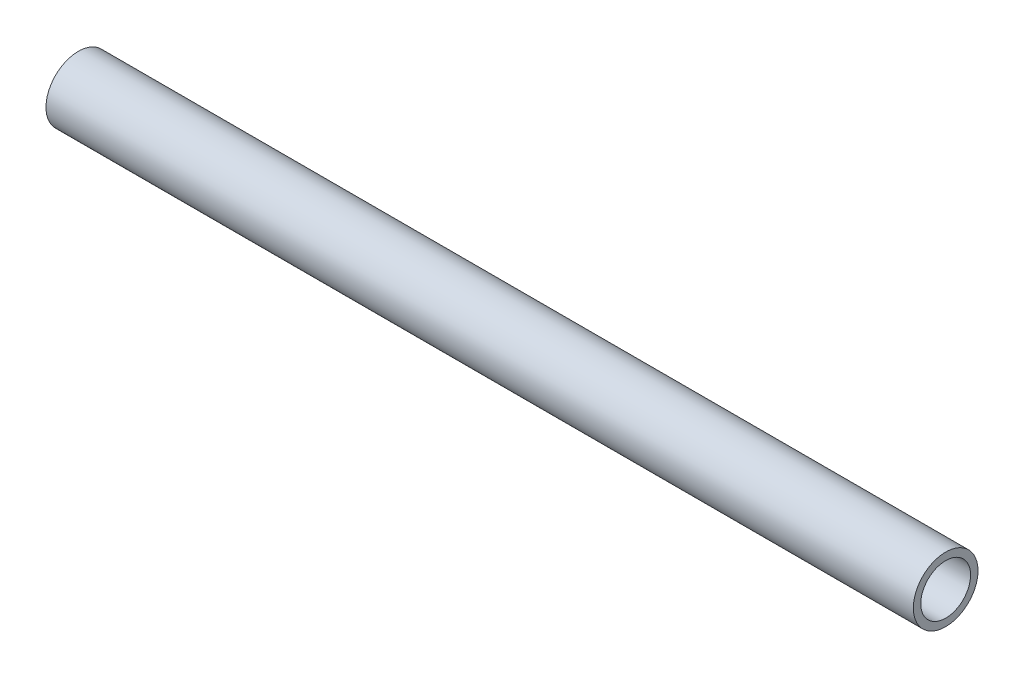
ISO-10303-21;
HEADER;
FILE_DESCRIPTION(('STEP AP214'),'2;1');
FILE_NAME('part.step','',(''),(''),'','','');
FILE_SCHEMA(('AUTOMOTIVE_DESIGN { 1 0 10303 214 1 1 1 1 }'));
ENDSEC;
DATA;
#1=APPLICATION_CONTEXT('core data for automotive mechanical design processes');
#2=APPLICATION_PROTOCOL_DEFINITION('international standard','automotive_design',2000,#1);
#3=PRODUCT_CONTEXT('',#1,'mechanical');
#4=PRODUCT('Part','Part','',(#3));
#5=PRODUCT_RELATED_PRODUCT_CATEGORY('part','',(#4));
#6=PRODUCT_DEFINITION_FORMATION('','',#4);
#7=PRODUCT_DEFINITION_CONTEXT('part definition',#1,'design');
#8=PRODUCT_DEFINITION('design','',#6,#7);
#9=PRODUCT_DEFINITION_SHAPE('','',#8);
#10=(LENGTH_UNIT() NAMED_UNIT(*) SI_UNIT(.MILLI.,.METRE.));
#11=(NAMED_UNIT(*) PLANE_ANGLE_UNIT() SI_UNIT($,.RADIAN.));
#12=(NAMED_UNIT(*) SI_UNIT($,.STERADIAN.) SOLID_ANGLE_UNIT());
#13=UNCERTAINTY_MEASURE_WITH_UNIT(LENGTH_MEASURE(1.E-05),#10,'distance_accuracy_value','');
#14=(GEOMETRIC_REPRESENTATION_CONTEXT(3) GLOBAL_UNCERTAINTY_ASSIGNED_CONTEXT((#13)) GLOBAL_UNIT_ASSIGNED_CONTEXT((#10,
#11,#12)) REPRESENTATION_CONTEXT('',''));
#15=CARTESIAN_POINT('',(0.,0.,0.));
#16=DIRECTION('',(0.,0.,1.));
#17=DIRECTION('',(1.,0.,0.));
#18=AXIS2_PLACEMENT_3D('',#15,#16,#17);
#19=CARTESIAN_POINT('',(-110.229678615723,0.,0.));
#20=DIRECTION('',(-1.,0.,0.));
#21=DIRECTION('',(0.,-1.,0.));
#22=AXIS2_PLACEMENT_3D('',#19,#20,#21);
#23=CYLINDRICAL_SURFACE('',#22,8.57249999999996);
#24=CARTESIAN_POINT('',(-140.,0.,0.));
#25=DIRECTION('',(-1.,0.,0.));
#26=DIRECTION('',(0.,-1.,0.));
#27=AXIS2_PLACEMENT_3D('',#24,#25,#26);
#28=CIRCLE('',#27,8.57249999999995);
#29=CARTESIAN_POINT('',(-140.,-8.57249999999995,0.));
#30=VERTEX_POINT('',#29);
#31=EDGE_CURVE('E56',#30,#30,#28,.T.);
#32=ORIENTED_EDGE('',*,*,#31,.F.);
#33=EDGE_LOOP('',(#32));
#34=FACE_BOUND('',#33,.T.);
#35=CARTESIAN_POINT('',(89.8802,0.,0.));
#36=DIRECTION('',(-1.,0.,0.));
#37=DIRECTION('',(0.,-1.,0.));
#38=AXIS2_PLACEMENT_3D('',#35,#36,#37);
#39=CIRCLE('',#38,8.57249999999997);
#40=CARTESIAN_POINT('',(89.8802,-8.57249999999995,0.));
#41=VERTEX_POINT('',#40);
#42=EDGE_CURVE('E10',#41,#41,#39,.T.);
#43=ORIENTED_EDGE('',*,*,#42,.T.);
#44=EDGE_LOOP('',(#43));
#45=FACE_BOUND('',#44,.T.);
#46=ADVANCED_FACE('F28',(#34,#45),#23,.T.);
#47=CARTESIAN_POINT('',(89.8802,6.60400000000001,0.));
#48=DIRECTION('',(-1.,0.,0.));
#49=DIRECTION('',(0.,-1.,0.));
#50=AXIS2_PLACEMENT_3D('',#47,#48,#49);
#51=PLANE('',#50);
#52=ORIENTED_EDGE('',*,*,#42,.F.);
#53=EDGE_LOOP('',(#52));
#54=FACE_BOUND('',#53,.T.);
#55=CARTESIAN_POINT('',(89.8802,0.,0.));
#56=DIRECTION('',(-1.,0.,0.));
#57=DIRECTION('',(0.,-1.,0.));
#58=AXIS2_PLACEMENT_3D('',#55,#56,#57);
#59=CIRCLE('',#58,6.60399999999998);
#60=CARTESIAN_POINT('',(89.8802,-6.60399999999996,0.));
#61=VERTEX_POINT('',#60);
#62=EDGE_CURVE('E34',#61,#61,#59,.T.);
#63=ORIENTED_EDGE('',*,*,#62,.T.);
#64=EDGE_LOOP('',(#63));
#65=FACE_BOUND('',#64,.T.);
#66=ADVANCED_FACE('F63',(#54,#65),#51,.F.);
#67=CARTESIAN_POINT('',(-110.229678615723,0.,0.));
#68=DIRECTION('',(-1.,0.,0.));
#69=DIRECTION('',(0.,-1.,0.));
#70=AXIS2_PLACEMENT_3D('',#67,#68,#69);
#71=CYLINDRICAL_SURFACE('',#70,6.60399999999998);
#72=ORIENTED_EDGE('',*,*,#62,.F.);
#73=EDGE_LOOP('',(#72));
#74=FACE_BOUND('',#73,.T.);
#75=CARTESIAN_POINT('',(79.7202,0.,0.));
#76=DIRECTION('',(-1.,0.,0.));
#77=DIRECTION('',(0.,-1.,0.));
#78=AXIS2_PLACEMENT_3D('',#75,#76,#77);
#79=CIRCLE('',#78,6.60399999999998);
#80=CARTESIAN_POINT('',(79.7202,-6.60399999999995,0.));
#81=VERTEX_POINT('',#80);
#82=EDGE_CURVE('E38',#81,#81,#79,.T.);
#83=ORIENTED_EDGE('',*,*,#82,.T.);
#84=EDGE_LOOP('',(#83));
#85=FACE_BOUND('',#84,.T.);
#86=ADVANCED_FACE('F67',(#74,#85),#71,.F.);
#87=CARTESIAN_POINT('',(79.7202,6.604,0.));
#88=DIRECTION('',(-1.,0.,0.));
#89=DIRECTION('',(0.,-1.,0.));
#90=AXIS2_PLACEMENT_3D('',#87,#88,#89);
#91=PLANE('',#90);
#92=ORIENTED_EDGE('',*,*,#82,.F.);
#93=EDGE_LOOP('',(#92));
#94=FACE_BOUND('',#93,.T.);
#95=CARTESIAN_POINT('',(79.7202,0.,0.));
#96=DIRECTION('',(-1.,0.,0.));
#97=DIRECTION('',(0.,-1.,0.));
#98=AXIS2_PLACEMENT_3D('',#95,#96,#97);
#99=CIRCLE('',#98,6.23569999999997);
#100=CARTESIAN_POINT('',(79.7202,-6.23569999999995,0.));
#101=VERTEX_POINT('',#100);
#102=EDGE_CURVE('E42',#101,#101,#99,.T.);
#103=ORIENTED_EDGE('',*,*,#102,.T.);
#104=EDGE_LOOP('',(#103));
#105=FACE_BOUND('',#104,.T.);
#106=ADVANCED_FACE('F72',(#94,#105),#91,.F.);
#107=CARTESIAN_POINT('',(-110.229678615723,0.,0.));
#108=DIRECTION('',(-1.,0.,0.));
#109=DIRECTION('',(0.,-1.,0.));
#110=AXIS2_PLACEMENT_3D('',#107,#108,#109);
#111=CYLINDRICAL_SURFACE('',#110,6.23569999999996);
#112=ORIENTED_EDGE('',*,*,#102,.F.);
#113=EDGE_LOOP('',(#112));
#114=FACE_BOUND('',#113,.T.);
#115=CARTESIAN_POINT('',(-129.84,0.,0.));
#116=DIRECTION('',(-1.,0.,0.));
#117=DIRECTION('',(0.,-1.,0.));
#118=AXIS2_PLACEMENT_3D('',#115,#116,#117);
#119=CIRCLE('',#118,6.23569999999995);
#120=CARTESIAN_POINT('',(-129.84,-6.23569999999995,0.));
#121=VERTEX_POINT('',#120);
#122=EDGE_CURVE('E47',#121,#121,#119,.T.);
#123=ORIENTED_EDGE('',*,*,#122,.T.);
#124=EDGE_LOOP('',(#123));
#125=FACE_BOUND('',#124,.T.);
#126=ADVANCED_FACE('F78',(#114,#125),#111,.F.);
#127=CARTESIAN_POINT('',(-129.84,6.23569999999994,0.));
#128=DIRECTION('',(1.,0.,0.));
#129=DIRECTION('',(0.,1.,0.));
#130=AXIS2_PLACEMENT_3D('',#127,#128,#129);
#131=PLANE('',#130);
#132=ORIENTED_EDGE('',*,*,#122,.F.);
#133=EDGE_LOOP('',(#132));
#134=FACE_BOUND('',#133,.T.);
#135=CARTESIAN_POINT('',(-129.84,0.,0.));
#136=DIRECTION('',(-1.,0.,0.));
#137=DIRECTION('',(0.,-1.,0.));
#138=AXIS2_PLACEMENT_3D('',#135,#136,#137);
#139=CIRCLE('',#138,6.60399999999995);
#140=CARTESIAN_POINT('',(-129.84,-6.60399999999995,0.));
#141=VERTEX_POINT('',#140);
#142=EDGE_CURVE('E50',#141,#141,#139,.T.);
#143=ORIENTED_EDGE('',*,*,#142,.T.);
#144=EDGE_LOOP('',(#143));
#145=FACE_BOUND('',#144,.T.);
#146=ADVANCED_FACE('F82',(#134,#145),#131,.F.);
#147=CARTESIAN_POINT('',(-110.229678615723,0.,0.));
#148=DIRECTION('',(-1.,0.,0.));
#149=DIRECTION('',(0.,-1.,0.));
#150=AXIS2_PLACEMENT_3D('',#147,#148,#149);
#151=CYLINDRICAL_SURFACE('',#150,6.60399999999995);
#152=ORIENTED_EDGE('',*,*,#142,.F.);
#153=EDGE_LOOP('',(#152));
#154=FACE_BOUND('',#153,.T.);
#155=CARTESIAN_POINT('',(-140.,0.,0.));
#156=DIRECTION('',(-1.,0.,0.));
#157=DIRECTION('',(0.,-1.,0.));
#158=AXIS2_PLACEMENT_3D('',#155,#156,#157);
#159=CIRCLE('',#158,6.60399999999995);
#160=CARTESIAN_POINT('',(-140.,-6.60399999999996,0.));
#161=VERTEX_POINT('',#160);
#162=EDGE_CURVE('E53',#161,#161,#159,.T.);
#163=ORIENTED_EDGE('',*,*,#162,.T.);
#164=EDGE_LOOP('',(#163));
#165=FACE_BOUND('',#164,.T.);
#166=ADVANCED_FACE('F86',(#154,#165),#151,.F.);
#167=CARTESIAN_POINT('',(-140.,6.60399999999995,0.));
#168=DIRECTION('',(1.,0.,0.));
#169=DIRECTION('',(0.,1.,0.));
#170=AXIS2_PLACEMENT_3D('',#167,#168,#169);
#171=PLANE('',#170);
#172=ORIENTED_EDGE('',*,*,#162,.F.);
#173=EDGE_LOOP('',(#172));
#174=FACE_BOUND('',#173,.T.);
#175=ORIENTED_EDGE('',*,*,#31,.T.);
#176=EDGE_LOOP('',(#175));
#177=FACE_BOUND('',#176,.T.);
#178=ADVANCED_FACE('F60',(#174,#177),#171,.F.);
#179=CLOSED_SHELL('',(#46,#66,#86,#106,#126,#146,#166,#178));
#180=MANIFOLD_SOLID_BREP('B2',#179);
#181=ADVANCED_BREP_SHAPE_REPRESENTATION('',(#18,#180),#14);
#182=SHAPE_DEFINITION_REPRESENTATION(#9,#181);
ENDSEC;
END-ISO-10303-21;
